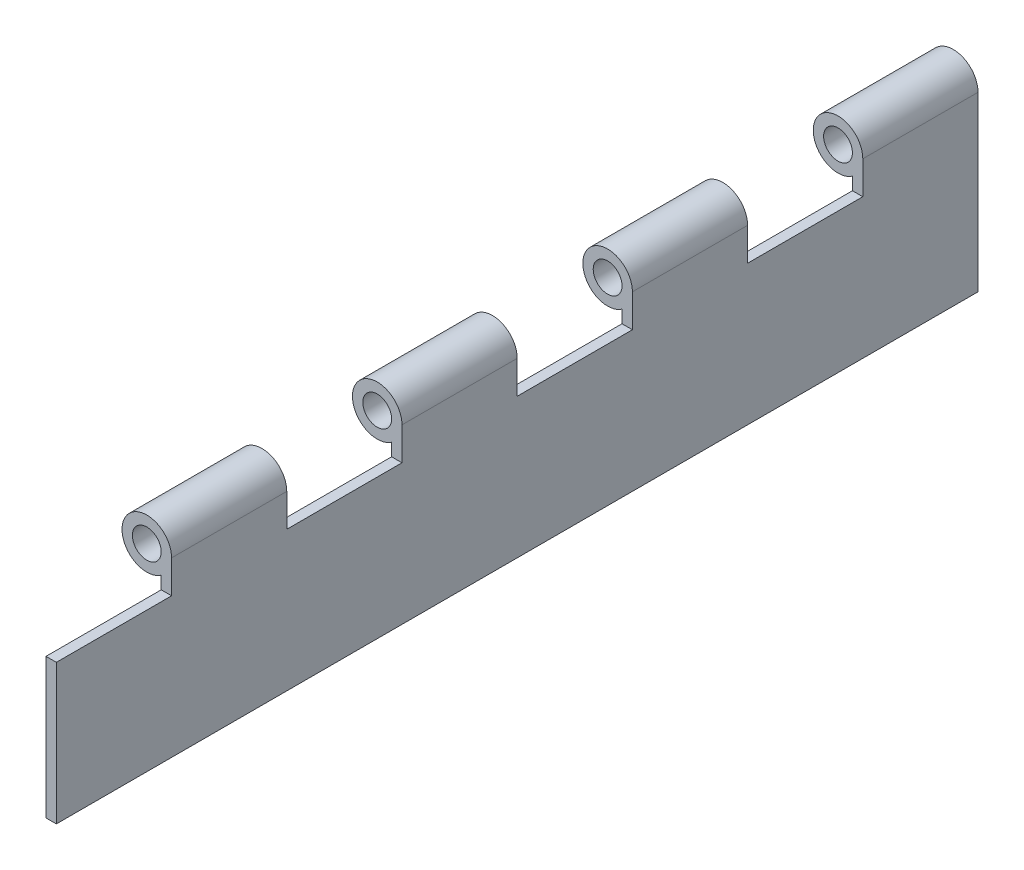
ISO-10303-21;
HEADER;
FILE_DESCRIPTION(('STEP AP214'),'2;1');
FILE_NAME('part.step','',(''),(''),'','','');
FILE_SCHEMA(('AUTOMOTIVE_DESIGN { 1 0 10303 214 1 1 1 1 }'));
ENDSEC;
DATA;
#1=APPLICATION_CONTEXT('core data for automotive mechanical design processes');
#2=APPLICATION_PROTOCOL_DEFINITION('international standard','automotive_design',2000,#1);
#3=PRODUCT_CONTEXT('',#1,'mechanical');
#4=PRODUCT('Part','Part','',(#3));
#5=PRODUCT_RELATED_PRODUCT_CATEGORY('part','',(#4));
#6=PRODUCT_DEFINITION_FORMATION('','',#4);
#7=PRODUCT_DEFINITION_CONTEXT('part definition',#1,'design');
#8=PRODUCT_DEFINITION('design','',#6,#7);
#9=PRODUCT_DEFINITION_SHAPE('','',#8);
#10=(LENGTH_UNIT() NAMED_UNIT(*) SI_UNIT(.MILLI.,.METRE.));
#11=(NAMED_UNIT(*) PLANE_ANGLE_UNIT() SI_UNIT($,.RADIAN.));
#12=(NAMED_UNIT(*) SI_UNIT($,.STERADIAN.) SOLID_ANGLE_UNIT());
#13=UNCERTAINTY_MEASURE_WITH_UNIT(LENGTH_MEASURE(1.E-05),#10,'distance_accuracy_value','');
#14=(GEOMETRIC_REPRESENTATION_CONTEXT(3) GLOBAL_UNCERTAINTY_ASSIGNED_CONTEXT((#13)) GLOBAL_UNIT_ASSIGNED_CONTEXT((#10,
#11,#12)) REPRESENTATION_CONTEXT('',''));
#15=CARTESIAN_POINT('',(0.,0.,0.));
#16=DIRECTION('',(0.,0.,1.));
#17=DIRECTION('',(1.,0.,0.));
#18=AXIS2_PLACEMENT_3D('',#15,#16,#17);
#19=CARTESIAN_POINT('',(0.,0.,203.2));
#20=DIRECTION('',(0.,0.,-1.));
#21=DIRECTION('',(-1.,0.,0.));
#22=AXIS2_PLACEMENT_3D('',#19,#20,#21);
#23=CYLINDRICAL_SURFACE('',#22,5.461);
#24=DIRECTION('',(0.,0.,-1.));
#25=VECTOR('',#24,1.);
#26=CARTESIAN_POINT('',(5.461,0.,203.2));
#27=LINE('',#26,#25);
#28=CARTESIAN_POINT('',(5.461,0.,177.8));
#29=VERTEX_POINT('',#28);
#30=CARTESIAN_POINT('',(5.461,0.,152.4));
#31=VERTEX_POINT('',#30);
#32=EDGE_CURVE('E291',#29,#31,#27,.T.);
#33=ORIENTED_EDGE('',*,*,#32,.T.);
#34=CARTESIAN_POINT('',(0.,0.,152.4));
#35=DIRECTION('',(0.,0.,1.));
#36=DIRECTION('',(1.,0.,0.));
#37=AXIS2_PLACEMENT_3D('',#34,#35,#36);
#38=CIRCLE('',#37,5.461);
#39=CARTESIAN_POINT('',(3.17500000000001,-4.44318534387211,152.4));
#40=VERTEX_POINT('',#39);
#41=EDGE_CURVE('E241',#31,#40,#38,.T.);
#42=ORIENTED_EDGE('',*,*,#41,.T.);
#43=DIRECTION('',(0.,0.,-1.));
#44=VECTOR('',#43,1.);
#45=CARTESIAN_POINT('',(3.17500000000001,-4.44318534387211,203.2));
#46=LINE('',#45,#44);
#47=CARTESIAN_POINT('',(3.17500000000001,-4.44318534387211,177.8));
#48=VERTEX_POINT('',#47);
#49=EDGE_CURVE('E11',#48,#40,#46,.T.);
#50=ORIENTED_EDGE('',*,*,#49,.F.);
#51=CARTESIAN_POINT('',(0.,0.,177.8));
#52=DIRECTION('',(0.,0.,-1.));
#53=DIRECTION('',(-1.,0.,0.));
#54=AXIS2_PLACEMENT_3D('',#51,#52,#53);
#55=CIRCLE('',#54,5.461);
#56=EDGE_CURVE('E265',#48,#29,#55,.T.);
#57=ORIENTED_EDGE('',*,*,#56,.T.);
#58=EDGE_LOOP('',(#33,#42,#50,#57));
#59=FACE_BOUND('',#58,.T.);
#60=ADVANCED_FACE('F32',(#59),#23,.T.);
#61=CARTESIAN_POINT('',(3.17500000000001,-4.44318534387211,127.));
#62=VERTEX_POINT('',#61);
#63=CARTESIAN_POINT('',(3.17500000000001,-4.44318534387211,101.6));
#64=VERTEX_POINT('',#63);
#65=EDGE_CURVE('E41',#62,#64,#46,.T.);
#66=ORIENTED_EDGE('',*,*,#65,.F.);
#67=CARTESIAN_POINT('',(0.,0.,127.));
#68=DIRECTION('',(0.,0.,-1.));
#69=DIRECTION('',(-1.,0.,0.));
#70=AXIS2_PLACEMENT_3D('',#67,#68,#69);
#71=CIRCLE('',#70,5.461);
#72=CARTESIAN_POINT('',(5.461,0.,127.));
#73=VERTEX_POINT('',#72);
#74=EDGE_CURVE('E236',#62,#73,#71,.T.);
#75=ORIENTED_EDGE('',*,*,#74,.T.);
#76=CARTESIAN_POINT('',(5.461,0.,101.6));
#77=VERTEX_POINT('',#76);
#78=EDGE_CURVE('E182',#73,#77,#27,.T.);
#79=ORIENTED_EDGE('',*,*,#78,.T.);
#80=CARTESIAN_POINT('',(0.,0.,101.6));
#81=DIRECTION('',(0.,0.,1.));
#82=DIRECTION('',(1.,0.,0.));
#83=AXIS2_PLACEMENT_3D('',#80,#81,#82);
#84=CIRCLE('',#83,5.461);
#85=EDGE_CURVE('E232',#77,#64,#84,.T.);
#86=ORIENTED_EDGE('',*,*,#85,.T.);
#87=EDGE_LOOP('',(#66,#75,#79,#86));
#88=FACE_BOUND('',#87,.T.);
#89=ADVANCED_FACE('F336',(#88),#23,.T.);
#90=CARTESIAN_POINT('',(3.17500000000001,-4.44318534387211,76.2));
#91=VERTEX_POINT('',#90);
#92=CARTESIAN_POINT('',(3.17500000000001,-4.44318534387211,50.8));
#93=VERTEX_POINT('',#92);
#94=EDGE_CURVE('E366',#91,#93,#46,.T.);
#95=ORIENTED_EDGE('',*,*,#94,.F.);
#96=CARTESIAN_POINT('',(0.,0.,76.2));
#97=DIRECTION('',(0.,0.,-1.));
#98=DIRECTION('',(-1.,0.,0.));
#99=AXIS2_PLACEMENT_3D('',#96,#97,#98);
#100=CIRCLE('',#99,5.461);
#101=CARTESIAN_POINT('',(5.461,0.,76.2));
#102=VERTEX_POINT('',#101);
#103=EDGE_CURVE('E226',#91,#102,#100,.T.);
#104=ORIENTED_EDGE('',*,*,#103,.T.);
#105=CARTESIAN_POINT('',(5.461,0.,50.8));
#106=VERTEX_POINT('',#105);
#107=EDGE_CURVE('E378',#102,#106,#27,.T.);
#108=ORIENTED_EDGE('',*,*,#107,.T.);
#109=CARTESIAN_POINT('',(0.,0.,50.8));
#110=DIRECTION('',(0.,0.,1.));
#111=DIRECTION('',(1.,0.,0.));
#112=AXIS2_PLACEMENT_3D('',#109,#110,#111);
#113=CIRCLE('',#112,5.461);
#114=EDGE_CURVE('E220',#106,#93,#113,.T.);
#115=ORIENTED_EDGE('',*,*,#114,.T.);
#116=EDGE_LOOP('',(#95,#104,#108,#115));
#117=FACE_BOUND('',#116,.T.);
#118=ADVANCED_FACE('F341',(#117),#23,.T.);
#119=CARTESIAN_POINT('',(0.,0.,203.2));
#120=DIRECTION('',(0.,0.,-1.));
#121=DIRECTION('',(-1.,0.,0.));
#122=AXIS2_PLACEMENT_3D('',#119,#120,#121);
#123=CYLINDRICAL_SURFACE('',#122,3.175);
#124=CARTESIAN_POINT('',(0.,0.,152.4));
#125=DIRECTION('',(0.,0.,1.));
#126=DIRECTION('',(1.,0.,0.));
#127=AXIS2_PLACEMENT_3D('',#124,#125,#126);
#128=CIRCLE('',#127,3.175);
#129=CARTESIAN_POINT('',(3.175,0.,152.4));
#130=VERTEX_POINT('',#129);
#131=EDGE_CURVE('E36',#130,#130,#128,.T.);
#132=ORIENTED_EDGE('',*,*,#131,.F.);
#133=EDGE_LOOP('',(#132));
#134=FACE_BOUND('',#133,.T.);
#135=CARTESIAN_POINT('',(0.,0.,177.8));
#136=DIRECTION('',(0.,0.,-1.));
#137=DIRECTION('',(-1.,0.,0.));
#138=AXIS2_PLACEMENT_3D('',#135,#136,#137);
#139=CIRCLE('',#138,3.175);
#140=CARTESIAN_POINT('',(-3.175,0.,177.8));
#141=VERTEX_POINT('',#140);
#142=EDGE_CURVE('E260',#141,#141,#139,.T.);
#143=ORIENTED_EDGE('',*,*,#142,.F.);
#144=EDGE_LOOP('',(#143));
#145=FACE_BOUND('',#144,.T.);
#146=ADVANCED_FACE('F319',(#134,#145),#123,.F.);
#147=CARTESIAN_POINT('',(0.,0.,203.2));
#148=DIRECTION('',(0.,0.,1.));
#149=DIRECTION('',(1.,0.,0.));
#150=AXIS2_PLACEMENT_3D('',#147,#148,#149);
#151=PLANE('',#150);
#152=DIRECTION('',(1.,0.,0.));
#153=VECTOR('',#152,1.);
#154=CARTESIAN_POINT('',(-5.461,-7.239,203.2));
#155=LINE('',#154,#153);
#156=CARTESIAN_POINT('',(3.17500000000001,-7.239,203.2));
#157=VERTEX_POINT('',#156);
#158=CARTESIAN_POINT('',(5.461,-7.239,203.2));
#159=VERTEX_POINT('',#158);
#160=EDGE_CURVE('E257',#157,#159,#155,.T.);
#161=ORIENTED_EDGE('',*,*,#160,.F.);
#162=DIRECTION('',(0.,-1.,0.));
#163=VECTOR('',#162,1.);
#164=CARTESIAN_POINT('',(3.17500000000001,-38.1,203.2));
#165=LINE('',#164,#163);
#166=CARTESIAN_POINT('',(3.17500000000001,-38.1,203.2));
#167=VERTEX_POINT('',#166);
#168=EDGE_CURVE('E274',#157,#167,#165,.T.);
#169=ORIENTED_EDGE('',*,*,#168,.T.);
#170=DIRECTION('',(1.,0.,0.));
#171=VECTOR('',#170,1.);
#172=CARTESIAN_POINT('',(5.461,-38.1,203.2));
#173=LINE('',#172,#171);
#174=CARTESIAN_POINT('',(5.461,-38.1,203.2));
#175=VERTEX_POINT('',#174);
#176=EDGE_CURVE('E276',#167,#175,#173,.T.);
#177=ORIENTED_EDGE('',*,*,#176,.T.);
#178=DIRECTION('',(0.,1.,0.));
#179=VECTOR('',#178,1.);
#180=CARTESIAN_POINT('',(5.461,0.,203.2));
#181=LINE('',#180,#179);
#182=EDGE_CURVE('E279',#175,#159,#181,.T.);
#183=ORIENTED_EDGE('',*,*,#182,.T.);
#184=EDGE_LOOP('',(#161,#169,#177,#183));
#185=FACE_BOUND('',#184,.T.);
#186=ADVANCED_FACE('F353',(#185),#151,.T.);
#187=CARTESIAN_POINT('',(0.,0.,0.));
#188=DIRECTION('',(0.,0.,1.));
#189=DIRECTION('',(1.,0.,0.));
#190=AXIS2_PLACEMENT_3D('',#187,#188,#189);
#191=PLANE('',#190);
#192=CARTESIAN_POINT('',(0.,0.,0.));
#193=DIRECTION('',(0.,0.,1.));
#194=DIRECTION('',(1.,0.,0.));
#195=AXIS2_PLACEMENT_3D('',#192,#193,#194);
#196=CIRCLE('',#195,5.461);
#197=CARTESIAN_POINT('',(5.461,0.,0.));
#198=VERTEX_POINT('',#197);
#199=CARTESIAN_POINT('',(3.17500000000001,-4.44318534387211,0.));
#200=VERTEX_POINT('',#199);
#201=EDGE_CURVE('E273',#198,#200,#196,.T.);
#202=ORIENTED_EDGE('',*,*,#201,.F.);
#203=DIRECTION('',(0.,1.,0.));
#204=VECTOR('',#203,1.);
#205=CARTESIAN_POINT('',(5.461,0.,0.));
#206=LINE('',#205,#204);
#207=CARTESIAN_POINT('',(5.461,-38.1,0.));
#208=VERTEX_POINT('',#207);
#209=EDGE_CURVE('E277',#208,#198,#206,.T.);
#210=ORIENTED_EDGE('',*,*,#209,.F.);
#211=DIRECTION('',(1.,0.,0.));
#212=VECTOR('',#211,1.);
#213=CARTESIAN_POINT('',(5.461,-38.1,0.));
#214=LINE('',#213,#212);
#215=CARTESIAN_POINT('',(3.17500000000001,-38.1,0.));
#216=VERTEX_POINT('',#215);
#217=EDGE_CURVE('E287',#216,#208,#214,.T.);
#218=ORIENTED_EDGE('',*,*,#217,.F.);
#219=DIRECTION('',(0.,-1.,0.));
#220=VECTOR('',#219,1.);
#221=CARTESIAN_POINT('',(3.17500000000001,-38.1,0.));
#222=LINE('',#221,#220);
#223=EDGE_CURVE('E285',#200,#216,#222,.T.);
#224=ORIENTED_EDGE('',*,*,#223,.F.);
#225=EDGE_LOOP('',(#202,#210,#218,#224));
#226=FACE_BOUND('',#225,.T.);
#227=CARTESIAN_POINT('',(0.,0.,0.));
#228=DIRECTION('',(0.,0.,1.));
#229=DIRECTION('',(1.,0.,0.));
#230=AXIS2_PLACEMENT_3D('',#227,#228,#229);
#231=CIRCLE('',#230,3.175);
#232=CARTESIAN_POINT('',(3.175,0.,0.));
#233=VERTEX_POINT('',#232);
#234=EDGE_CURVE('E270',#233,#233,#231,.T.);
#235=ORIENTED_EDGE('',*,*,#234,.T.);
#236=EDGE_LOOP('',(#235));
#237=FACE_BOUND('',#236,.T.);
#238=ADVANCED_FACE('F345',(#226,#237),#191,.F.);
#239=CARTESIAN_POINT('',(3.17500000000001,-4.44318534387211,25.4));
#240=VERTEX_POINT('',#239);
#241=EDGE_CURVE('E43',#240,#200,#46,.T.);
#242=ORIENTED_EDGE('',*,*,#241,.F.);
#243=CARTESIAN_POINT('',(0.,0.,25.4));
#244=DIRECTION('',(0.,0.,-1.));
#245=DIRECTION('',(-1.,0.,0.));
#246=AXIS2_PLACEMENT_3D('',#243,#244,#245);
#247=CIRCLE('',#246,5.461);
#248=CARTESIAN_POINT('',(5.461,0.,25.4));
#249=VERTEX_POINT('',#248);
#250=EDGE_CURVE('E214',#240,#249,#247,.T.);
#251=ORIENTED_EDGE('',*,*,#250,.T.);
#252=EDGE_CURVE('E282',#249,#198,#27,.T.);
#253=ORIENTED_EDGE('',*,*,#252,.T.);
#254=ORIENTED_EDGE('',*,*,#201,.T.);
#255=EDGE_LOOP('',(#242,#251,#253,#254));
#256=FACE_BOUND('',#255,.T.);
#257=ADVANCED_FACE('F34',(#256),#23,.T.);
#258=CARTESIAN_POINT('',(3.17500000000001,-38.1,203.2));
#259=DIRECTION('',(1.,0.,0.));
#260=DIRECTION('',(0.,1.,0.));
#261=AXIS2_PLACEMENT_3D('',#258,#259,#260);
#262=PLANE('',#261);
#263=ORIENTED_EDGE('',*,*,#49,.T.);
#264=DIRECTION('',(0.,-1.,0.));
#265=VECTOR('',#264,1.);
#266=CARTESIAN_POINT('',(3.17500000000001,-38.1,152.4));
#267=LINE('',#266,#265);
#268=CARTESIAN_POINT('',(3.17500000000001,-7.239,152.4));
#269=VERTEX_POINT('',#268);
#270=EDGE_CURVE('E238',#40,#269,#267,.T.);
#271=ORIENTED_EDGE('',*,*,#270,.T.);
#272=DIRECTION('',(0.,0.,-1.));
#273=VECTOR('',#272,1.);
#274=CARTESIAN_POINT('',(3.17500000000001,-7.239,203.2));
#275=LINE('',#274,#273);
#276=CARTESIAN_POINT('',(3.17500000000001,-7.239,127.));
#277=VERTEX_POINT('',#276);
#278=EDGE_CURVE('E249',#269,#277,#275,.T.);
#279=ORIENTED_EDGE('',*,*,#278,.T.);
#280=DIRECTION('',(0.,1.,0.));
#281=VECTOR('',#280,1.);
#282=CARTESIAN_POINT('',(3.17500000000001,-38.1,127.));
#283=LINE('',#282,#281);
#284=EDGE_CURVE('E169',#277,#62,#283,.T.);
#285=ORIENTED_EDGE('',*,*,#284,.T.);
#286=ORIENTED_EDGE('',*,*,#65,.T.);
#287=DIRECTION('',(0.,-1.,0.));
#288=VECTOR('',#287,1.);
#289=CARTESIAN_POINT('',(3.17500000000001,-38.1,101.6));
#290=LINE('',#289,#288);
#291=CARTESIAN_POINT('',(3.17500000000001,-7.239,101.6));
#292=VERTEX_POINT('',#291);
#293=EDGE_CURVE('E229',#64,#292,#290,.T.);
#294=ORIENTED_EDGE('',*,*,#293,.T.);
#295=DIRECTION('',(0.,0.,-1.));
#296=VECTOR('',#295,1.);
#297=CARTESIAN_POINT('',(3.17500000000001,-7.239,203.2));
#298=LINE('',#297,#296);
#299=CARTESIAN_POINT('',(3.17500000000001,-7.239,76.2));
#300=VERTEX_POINT('',#299);
#301=EDGE_CURVE('E246',#292,#300,#298,.T.);
#302=ORIENTED_EDGE('',*,*,#301,.T.);
#303=DIRECTION('',(0.,1.,0.));
#304=VECTOR('',#303,1.);
#305=CARTESIAN_POINT('',(3.17500000000001,-38.1,76.2));
#306=LINE('',#305,#304);
#307=EDGE_CURVE('E223',#300,#91,#306,.T.);
#308=ORIENTED_EDGE('',*,*,#307,.T.);
#309=ORIENTED_EDGE('',*,*,#94,.T.);
#310=DIRECTION('',(0.,-1.,0.));
#311=VECTOR('',#310,1.);
#312=CARTESIAN_POINT('',(3.17500000000001,-38.1,50.8));
#313=LINE('',#312,#311);
#314=CARTESIAN_POINT('',(3.17500000000001,-7.239,50.8));
#315=VERTEX_POINT('',#314);
#316=EDGE_CURVE('E217',#93,#315,#313,.T.);
#317=ORIENTED_EDGE('',*,*,#316,.T.);
#318=DIRECTION('',(0.,0.,-1.));
#319=VECTOR('',#318,1.);
#320=CARTESIAN_POINT('',(3.17500000000001,-7.239,203.2));
#321=LINE('',#320,#319);
#322=CARTESIAN_POINT('',(3.17500000000001,-7.239,25.4));
#323=VERTEX_POINT('',#322);
#324=EDGE_CURVE('E243',#315,#323,#321,.T.);
#325=ORIENTED_EDGE('',*,*,#324,.T.);
#326=DIRECTION('',(0.,1.,0.));
#327=VECTOR('',#326,1.);
#328=CARTESIAN_POINT('',(3.17500000000001,-38.1,25.4));
#329=LINE('',#328,#327);
#330=EDGE_CURVE('E211',#323,#240,#329,.T.);
#331=ORIENTED_EDGE('',*,*,#330,.T.);
#332=ORIENTED_EDGE('',*,*,#241,.T.);
#333=ORIENTED_EDGE('',*,*,#223,.T.);
#334=DIRECTION('',(0.,0.,-1.));
#335=VECTOR('',#334,1.);
#336=CARTESIAN_POINT('',(3.17500000000001,-38.1,203.2));
#337=LINE('',#336,#335);
#338=EDGE_CURVE('E297',#167,#216,#337,.T.);
#339=ORIENTED_EDGE('',*,*,#338,.F.);
#340=ORIENTED_EDGE('',*,*,#168,.F.);
#341=DIRECTION('',(0.,0.,-1.));
#342=VECTOR('',#341,1.);
#343=CARTESIAN_POINT('',(3.17500000000001,-7.239,203.2));
#344=LINE('',#343,#342);
#345=CARTESIAN_POINT('',(3.17500000000001,-7.239,177.8));
#346=VERTEX_POINT('',#345);
#347=EDGE_CURVE('E267',#157,#346,#344,.T.);
#348=ORIENTED_EDGE('',*,*,#347,.T.);
#349=DIRECTION('',(0.,1.,0.));
#350=VECTOR('',#349,1.);
#351=CARTESIAN_POINT('',(3.17500000000001,-38.1,177.8));
#352=LINE('',#351,#350);
#353=EDGE_CURVE('E262',#346,#48,#352,.T.);
#354=ORIENTED_EDGE('',*,*,#353,.T.);
#355=EDGE_LOOP('',(#263,#271,#279,#285,#286,#294,#302,#308,#309,#317,#325,#331,#332,#333,#339,
#340,#348,#354));
#356=FACE_BOUND('',#355,.T.);
#357=ADVANCED_FACE('F344',(#356),#262,.F.);
#358=CARTESIAN_POINT('',(5.461,-38.1,203.2));
#359=DIRECTION('',(0.,1.,0.));
#360=DIRECTION('',(0.,0.,1.));
#361=AXIS2_PLACEMENT_3D('',#358,#359,#360);
#362=PLANE('',#361);
#363=ORIENTED_EDGE('',*,*,#217,.T.);
#364=DIRECTION('',(0.,0.,-1.));
#365=VECTOR('',#364,1.);
#366=CARTESIAN_POINT('',(5.461,-38.1,203.2));
#367=LINE('',#366,#365);
#368=EDGE_CURVE('E294',#175,#208,#367,.T.);
#369=ORIENTED_EDGE('',*,*,#368,.F.);
#370=ORIENTED_EDGE('',*,*,#176,.F.);
#371=ORIENTED_EDGE('',*,*,#338,.T.);
#372=EDGE_LOOP('',(#363,#369,#370,#371));
#373=FACE_BOUND('',#372,.T.);
#374=ADVANCED_FACE('F351',(#373),#362,.F.);
#375=CARTESIAN_POINT('',(5.461,0.,203.2));
#376=DIRECTION('',(-1.,0.,0.));
#377=DIRECTION('',(0.,-1.,0.));
#378=AXIS2_PLACEMENT_3D('',#375,#376,#377);
#379=PLANE('',#378);
#380=DIRECTION('',(0.,0.,-1.));
#381=VECTOR('',#380,1.);
#382=CARTESIAN_POINT('',(5.461,-7.239,152.4));
#383=LINE('',#382,#381);
#384=CARTESIAN_POINT('',(5.461,-7.239,152.4));
#385=VERTEX_POINT('',#384);
#386=CARTESIAN_POINT('',(5.461,-7.239,127.));
#387=VERTEX_POINT('',#386);
#388=EDGE_CURVE('E176',#385,#387,#383,.T.);
#389=ORIENTED_EDGE('',*,*,#388,.F.);
#390=DIRECTION('',(0.,-1.,0.));
#391=VECTOR('',#390,1.);
#392=CARTESIAN_POINT('',(5.461,5.461,152.4));
#393=LINE('',#392,#391);
#394=EDGE_CURVE('E50',#31,#385,#393,.T.);
#395=ORIENTED_EDGE('',*,*,#394,.F.);
#396=ORIENTED_EDGE('',*,*,#32,.F.);
#397=DIRECTION('',(0.,1.,0.));
#398=VECTOR('',#397,1.);
#399=CARTESIAN_POINT('',(5.461,5.461,177.8));
#400=LINE('',#399,#398);
#401=CARTESIAN_POINT('',(5.461,-7.239,177.8));
#402=VERTEX_POINT('',#401);
#403=EDGE_CURVE('E254',#402,#29,#400,.T.);
#404=ORIENTED_EDGE('',*,*,#403,.F.);
#405=DIRECTION('',(0.,0.,-1.));
#406=VECTOR('',#405,1.);
#407=CARTESIAN_POINT('',(5.461,-7.239,203.2));
#408=LINE('',#407,#406);
#409=EDGE_CURVE('E251',#159,#402,#408,.T.);
#410=ORIENTED_EDGE('',*,*,#409,.F.);
#411=ORIENTED_EDGE('',*,*,#182,.F.);
#412=ORIENTED_EDGE('',*,*,#368,.T.);
#413=ORIENTED_EDGE('',*,*,#209,.T.);
#414=ORIENTED_EDGE('',*,*,#252,.F.);
#415=DIRECTION('',(0.,1.,0.));
#416=VECTOR('',#415,1.);
#417=CARTESIAN_POINT('',(5.461,5.461,25.4));
#418=LINE('',#417,#416);
#419=CARTESIAN_POINT('',(5.461,-7.239,25.4));
#420=VERTEX_POINT('',#419);
#421=EDGE_CURVE('E204',#420,#249,#418,.T.);
#422=ORIENTED_EDGE('',*,*,#421,.F.);
#423=DIRECTION('',(0.,0.,-1.));
#424=VECTOR('',#423,1.);
#425=CARTESIAN_POINT('',(5.461,-7.239,50.8));
#426=LINE('',#425,#424);
#427=CARTESIAN_POINT('',(5.461,-7.239,50.8));
#428=VERTEX_POINT('',#427);
#429=EDGE_CURVE('E201',#428,#420,#426,.T.);
#430=ORIENTED_EDGE('',*,*,#429,.F.);
#431=DIRECTION('',(0.,-1.,0.));
#432=VECTOR('',#431,1.);
#433=CARTESIAN_POINT('',(5.461,5.461,50.8));
#434=LINE('',#433,#432);
#435=EDGE_CURVE('E199',#106,#428,#434,.T.);
#436=ORIENTED_EDGE('',*,*,#435,.F.);
#437=ORIENTED_EDGE('',*,*,#107,.F.);
#438=DIRECTION('',(0.,1.,0.));
#439=VECTOR('',#438,1.);
#440=CARTESIAN_POINT('',(5.461,5.461,76.2));
#441=LINE('',#440,#439);
#442=CARTESIAN_POINT('',(5.461,-7.239,76.2));
#443=VERTEX_POINT('',#442);
#444=EDGE_CURVE('E192',#443,#102,#441,.T.);
#445=ORIENTED_EDGE('',*,*,#444,.F.);
#446=DIRECTION('',(0.,0.,-1.));
#447=VECTOR('',#446,1.);
#448=CARTESIAN_POINT('',(5.461,-7.239,101.6));
#449=LINE('',#448,#447);
#450=CARTESIAN_POINT('',(5.461,-7.239,101.6));
#451=VERTEX_POINT('',#450);
#452=EDGE_CURVE('E188',#451,#443,#449,.T.);
#453=ORIENTED_EDGE('',*,*,#452,.F.);
#454=DIRECTION('',(0.,-1.,0.));
#455=VECTOR('',#454,1.);
#456=CARTESIAN_POINT('',(5.461,5.461,101.6));
#457=LINE('',#456,#455);
#458=EDGE_CURVE('E58',#77,#451,#457,.T.);
#459=ORIENTED_EDGE('',*,*,#458,.F.);
#460=ORIENTED_EDGE('',*,*,#78,.F.);
#461=DIRECTION('',(0.,1.,0.));
#462=VECTOR('',#461,1.);
#463=CARTESIAN_POINT('',(5.461,5.461,127.));
#464=LINE('',#463,#462);
#465=EDGE_CURVE('E166',#387,#73,#464,.T.);
#466=ORIENTED_EDGE('',*,*,#465,.F.);
#467=EDGE_LOOP('',(#389,#395,#396,#404,#410,#411,#412,#413,#414,#422,#430,#436,#437,#445,#453,
#459,#460,#466));
#468=FACE_BOUND('',#467,.T.);
#469=ADVANCED_FACE('F180',(#468),#379,.F.);
#470=CARTESIAN_POINT('',(0.,0.,25.4));
#471=DIRECTION('',(0.,0.,-1.));
#472=DIRECTION('',(-1.,0.,0.));
#473=AXIS2_PLACEMENT_3D('',#470,#471,#472);
#474=CIRCLE('',#473,3.175);
#475=CARTESIAN_POINT('',(-3.175,0.,25.4));
#476=VERTEX_POINT('',#475);
#477=EDGE_CURVE('E172',#476,#476,#474,.T.);
#478=ORIENTED_EDGE('',*,*,#477,.F.);
#479=EDGE_LOOP('',(#478));
#480=FACE_BOUND('',#479,.T.);
#481=ORIENTED_EDGE('',*,*,#234,.F.);
#482=EDGE_LOOP('',(#481));
#483=FACE_BOUND('',#482,.T.);
#484=ADVANCED_FACE('F363',(#480,#483),#123,.F.);
#485=CARTESIAN_POINT('',(-5.461,-7.239,203.2));
#486=DIRECTION('',(0.,-1.,0.));
#487=DIRECTION('',(1.,0.,0.));
#488=AXIS2_PLACEMENT_3D('',#485,#486,#487);
#489=PLANE('',#488);
#490=ORIENTED_EDGE('',*,*,#160,.T.);
#491=ORIENTED_EDGE('',*,*,#409,.T.);
#492=DIRECTION('',(1.,0.,0.));
#493=VECTOR('',#492,1.);
#494=CARTESIAN_POINT('',(-5.461,-7.239,177.8));
#495=LINE('',#494,#493);
#496=EDGE_CURVE('E258',#346,#402,#495,.T.);
#497=ORIENTED_EDGE('',*,*,#496,.F.);
#498=ORIENTED_EDGE('',*,*,#347,.F.);
#499=EDGE_LOOP('',(#490,#491,#497,#498));
#500=FACE_BOUND('',#499,.T.);
#501=ADVANCED_FACE('F388',(#500),#489,.F.);
#502=CARTESIAN_POINT('',(-5.461,5.461,177.8));
#503=DIRECTION('',(0.,0.,-1.));
#504=DIRECTION('',(-1.,0.,0.));
#505=AXIS2_PLACEMENT_3D('',#502,#503,#504);
#506=PLANE('',#505);
#507=ORIENTED_EDGE('',*,*,#142,.T.);
#508=EDGE_LOOP('',(#507));
#509=FACE_BOUND('',#508,.T.);
#510=ORIENTED_EDGE('',*,*,#56,.F.);
#511=ORIENTED_EDGE('',*,*,#353,.F.);
#512=ORIENTED_EDGE('',*,*,#496,.T.);
#513=ORIENTED_EDGE('',*,*,#403,.T.);
#514=EDGE_LOOP('',(#510,#511,#512,#513));
#515=FACE_BOUND('',#514,.T.);
#516=ADVANCED_FACE('F393',(#509,#515),#506,.F.);
#517=CARTESIAN_POINT('',(-5.46100000000001,-7.239,50.8));
#518=DIRECTION('',(0.,-1.,0.));
#519=DIRECTION('',(1.,0.,0.));
#520=AXIS2_PLACEMENT_3D('',#517,#518,#519);
#521=PLANE('',#520);
#522=DIRECTION('',(1.,0.,0.));
#523=VECTOR('',#522,1.);
#524=CARTESIAN_POINT('',(-5.46100000000001,-7.239,50.8));
#525=LINE('',#524,#523);
#526=EDGE_CURVE('E207',#315,#428,#525,.T.);
#527=ORIENTED_EDGE('',*,*,#526,.T.);
#528=ORIENTED_EDGE('',*,*,#429,.T.);
#529=DIRECTION('',(1.,0.,0.));
#530=VECTOR('',#529,1.);
#531=CARTESIAN_POINT('',(-5.46100000000001,-7.239,25.4));
#532=LINE('',#531,#530);
#533=EDGE_CURVE('E189',#323,#420,#532,.T.);
#534=ORIENTED_EDGE('',*,*,#533,.F.);
#535=ORIENTED_EDGE('',*,*,#324,.F.);
#536=EDGE_LOOP('',(#527,#528,#534,#535));
#537=FACE_BOUND('',#536,.T.);
#538=ADVANCED_FACE('F410',(#537),#521,.F.);
#539=CARTESIAN_POINT('',(-5.46100000000001,5.461,50.8));
#540=DIRECTION('',(0.,0.,1.));
#541=DIRECTION('',(1.,0.,0.));
#542=AXIS2_PLACEMENT_3D('',#539,#540,#541);
#543=PLANE('',#542);
#544=CARTESIAN_POINT('',(0.,0.,50.8));
#545=DIRECTION('',(0.,0.,1.));
#546=DIRECTION('',(1.,0.,0.));
#547=AXIS2_PLACEMENT_3D('',#544,#545,#546);
#548=CIRCLE('',#547,3.175);
#549=CARTESIAN_POINT('',(3.175,0.,50.8));
#550=VERTEX_POINT('',#549);
#551=EDGE_CURVE('E216',#550,#550,#548,.T.);
#552=ORIENTED_EDGE('',*,*,#551,.T.);
#553=EDGE_LOOP('',(#552));
#554=FACE_BOUND('',#553,.T.);
#555=ORIENTED_EDGE('',*,*,#435,.T.);
#556=ORIENTED_EDGE('',*,*,#526,.F.);
#557=ORIENTED_EDGE('',*,*,#316,.F.);
#558=ORIENTED_EDGE('',*,*,#114,.F.);
#559=EDGE_LOOP('',(#555,#556,#557,#558));
#560=FACE_BOUND('',#559,.T.);
#561=ADVANCED_FACE('F408',(#554,#560),#543,.F.);
#562=CARTESIAN_POINT('',(-5.46100000000001,5.461,25.4));
#563=DIRECTION('',(0.,0.,-1.));
#564=DIRECTION('',(-1.,0.,0.));
#565=AXIS2_PLACEMENT_3D('',#562,#563,#564);
#566=PLANE('',#565);
#567=ORIENTED_EDGE('',*,*,#477,.T.);
#568=EDGE_LOOP('',(#567));
#569=FACE_BOUND('',#568,.T.);
#570=ORIENTED_EDGE('',*,*,#250,.F.);
#571=ORIENTED_EDGE('',*,*,#330,.F.);
#572=ORIENTED_EDGE('',*,*,#533,.T.);
#573=ORIENTED_EDGE('',*,*,#421,.T.);
#574=EDGE_LOOP('',(#570,#571,#572,#573));
#575=FACE_BOUND('',#574,.T.);
#576=ADVANCED_FACE('F413',(#569,#575),#566,.F.);
#577=CARTESIAN_POINT('',(0.,0.,76.2));
#578=DIRECTION('',(0.,0.,-1.));
#579=DIRECTION('',(-1.,0.,0.));
#580=AXIS2_PLACEMENT_3D('',#577,#578,#579);
#581=CIRCLE('',#580,3.175);
#582=CARTESIAN_POINT('',(-3.175,0.,76.2));
#583=VERTEX_POINT('',#582);
#584=EDGE_CURVE('E222',#583,#583,#581,.T.);
#585=ORIENTED_EDGE('',*,*,#584,.F.);
#586=EDGE_LOOP('',(#585));
#587=FACE_BOUND('',#586,.T.);
#588=ORIENTED_EDGE('',*,*,#551,.F.);
#589=EDGE_LOOP('',(#588));
#590=FACE_BOUND('',#589,.T.);
#591=ADVANCED_FACE('F318',(#587,#590),#123,.F.);
#592=CARTESIAN_POINT('',(-5.46100000000001,-7.239,101.6));
#593=DIRECTION('',(0.,-1.,0.));
#594=DIRECTION('',(1.,0.,0.));
#595=AXIS2_PLACEMENT_3D('',#592,#593,#594);
#596=PLANE('',#595);
#597=DIRECTION('',(1.,0.,0.));
#598=VECTOR('',#597,1.);
#599=CARTESIAN_POINT('',(-5.46100000000001,-7.239,101.6));
#600=LINE('',#599,#598);
#601=EDGE_CURVE('E195',#292,#451,#600,.T.);
#602=ORIENTED_EDGE('',*,*,#601,.T.);
#603=ORIENTED_EDGE('',*,*,#452,.T.);
#604=DIRECTION('',(1.,0.,0.));
#605=VECTOR('',#604,1.);
#606=CARTESIAN_POINT('',(-5.46100000000001,-7.239,76.2));
#607=LINE('',#606,#605);
#608=EDGE_CURVE('E196',#300,#443,#607,.T.);
#609=ORIENTED_EDGE('',*,*,#608,.F.);
#610=ORIENTED_EDGE('',*,*,#301,.F.);
#611=EDGE_LOOP('',(#602,#603,#609,#610));
#612=FACE_BOUND('',#611,.T.);
#613=ADVANCED_FACE('F324',(#612),#596,.F.);
#614=CARTESIAN_POINT('',(-5.46100000000001,5.461,101.6));
#615=DIRECTION('',(0.,0.,1.));
#616=DIRECTION('',(1.,0.,0.));
#617=AXIS2_PLACEMENT_3D('',#614,#615,#616);
#618=PLANE('',#617);
#619=CARTESIAN_POINT('',(0.,0.,101.6));
#620=DIRECTION('',(0.,0.,1.));
#621=DIRECTION('',(1.,0.,0.));
#622=AXIS2_PLACEMENT_3D('',#619,#620,#621);
#623=CIRCLE('',#622,3.175);
#624=CARTESIAN_POINT('',(3.175,0.,101.6));
#625=VERTEX_POINT('',#624);
#626=EDGE_CURVE('E228',#625,#625,#623,.T.);
#627=ORIENTED_EDGE('',*,*,#626,.T.);
#628=EDGE_LOOP('',(#627));
#629=FACE_BOUND('',#628,.T.);
#630=ORIENTED_EDGE('',*,*,#458,.T.);
#631=ORIENTED_EDGE('',*,*,#601,.F.);
#632=ORIENTED_EDGE('',*,*,#293,.F.);
#633=ORIENTED_EDGE('',*,*,#85,.F.);
#634=EDGE_LOOP('',(#630,#631,#632,#633));
#635=FACE_BOUND('',#634,.T.);
#636=ADVANCED_FACE('F322',(#629,#635),#618,.F.);
#637=CARTESIAN_POINT('',(-5.46100000000001,5.461,76.2));
#638=DIRECTION('',(0.,0.,-1.));
#639=DIRECTION('',(-1.,0.,0.));
#640=AXIS2_PLACEMENT_3D('',#637,#638,#639);
#641=PLANE('',#640);
#642=ORIENTED_EDGE('',*,*,#584,.T.);
#643=EDGE_LOOP('',(#642));
#644=FACE_BOUND('',#643,.T.);
#645=ORIENTED_EDGE('',*,*,#103,.F.);
#646=ORIENTED_EDGE('',*,*,#307,.F.);
#647=ORIENTED_EDGE('',*,*,#608,.T.);
#648=ORIENTED_EDGE('',*,*,#444,.T.);
#649=EDGE_LOOP('',(#645,#646,#647,#648));
#650=FACE_BOUND('',#649,.T.);
#651=ADVANCED_FACE('F316',(#644,#650),#641,.F.);
#652=CARTESIAN_POINT('',(0.,0.,127.));
#653=DIRECTION('',(0.,0.,-1.));
#654=DIRECTION('',(-1.,0.,0.));
#655=AXIS2_PLACEMENT_3D('',#652,#653,#654);
#656=CIRCLE('',#655,3.175);
#657=CARTESIAN_POINT('',(-3.175,0.,127.));
#658=VERTEX_POINT('',#657);
#659=EDGE_CURVE('E234',#658,#658,#656,.T.);
#660=ORIENTED_EDGE('',*,*,#659,.F.);
#661=EDGE_LOOP('',(#660));
#662=FACE_BOUND('',#661,.T.);
#663=ORIENTED_EDGE('',*,*,#626,.F.);
#664=EDGE_LOOP('',(#663));
#665=FACE_BOUND('',#664,.T.);
#666=ADVANCED_FACE('F313',(#662,#665),#123,.F.);
#667=CARTESIAN_POINT('',(-5.46100000000001,-7.239,152.4));
#668=DIRECTION('',(0.,-1.,0.));
#669=DIRECTION('',(1.,0.,0.));
#670=AXIS2_PLACEMENT_3D('',#667,#668,#669);
#671=PLANE('',#670);
#672=DIRECTION('',(1.,0.,0.));
#673=VECTOR('',#672,1.);
#674=CARTESIAN_POINT('',(-5.46100000000001,-7.239,152.4));
#675=LINE('',#674,#673);
#676=EDGE_CURVE('E173',#269,#385,#675,.T.);
#677=ORIENTED_EDGE('',*,*,#676,.T.);
#678=ORIENTED_EDGE('',*,*,#388,.T.);
#679=DIRECTION('',(1.,0.,0.));
#680=VECTOR('',#679,1.);
#681=CARTESIAN_POINT('',(-5.46100000000001,-7.239,127.));
#682=LINE('',#681,#680);
#683=EDGE_CURVE('E162',#277,#387,#682,.T.);
#684=ORIENTED_EDGE('',*,*,#683,.F.);
#685=ORIENTED_EDGE('',*,*,#278,.F.);
#686=EDGE_LOOP('',(#677,#678,#684,#685));
#687=FACE_BOUND('',#686,.T.);
#688=ADVANCED_FACE('F177',(#687),#671,.F.);
#689=CARTESIAN_POINT('',(-5.46100000000001,5.461,152.4));
#690=DIRECTION('',(0.,0.,1.));
#691=DIRECTION('',(1.,0.,0.));
#692=AXIS2_PLACEMENT_3D('',#689,#690,#691);
#693=PLANE('',#692);
#694=ORIENTED_EDGE('',*,*,#131,.T.);
#695=EDGE_LOOP('',(#694));
#696=FACE_BOUND('',#695,.T.);
#697=ORIENTED_EDGE('',*,*,#394,.T.);
#698=ORIENTED_EDGE('',*,*,#676,.F.);
#699=ORIENTED_EDGE('',*,*,#270,.F.);
#700=ORIENTED_EDGE('',*,*,#41,.F.);
#701=EDGE_LOOP('',(#697,#698,#699,#700));
#702=FACE_BOUND('',#701,.T.);
#703=ADVANCED_FACE('F396',(#696,#702),#693,.F.);
#704=CARTESIAN_POINT('',(-5.46100000000001,5.461,127.));
#705=DIRECTION('',(0.,0.,-1.));
#706=DIRECTION('',(-1.,0.,0.));
#707=AXIS2_PLACEMENT_3D('',#704,#705,#706);
#708=PLANE('',#707);
#709=ORIENTED_EDGE('',*,*,#659,.T.);
#710=EDGE_LOOP('',(#709));
#711=FACE_BOUND('',#710,.T.);
#712=ORIENTED_EDGE('',*,*,#74,.F.);
#713=ORIENTED_EDGE('',*,*,#284,.F.);
#714=ORIENTED_EDGE('',*,*,#683,.T.);
#715=ORIENTED_EDGE('',*,*,#465,.T.);
#716=EDGE_LOOP('',(#712,#713,#714,#715));
#717=FACE_BOUND('',#716,.T.);
#718=ADVANCED_FACE('F164',(#711,#717),#708,.F.);
#719=CLOSED_SHELL('',(#60,#89,#118,#146,#186,#238,#257,#357,#374,#469,#484,#501,#516,#538,#561,
#576,#591,#613,#636,#651,#666,#688,#703,#718));
#720=MANIFOLD_SOLID_BREP('B2',#719);
#721=ADVANCED_BREP_SHAPE_REPRESENTATION('',(#18,#720),#14);
#722=SHAPE_DEFINITION_REPRESENTATION(#9,#721);
ENDSEC;
END-ISO-10303-21;
